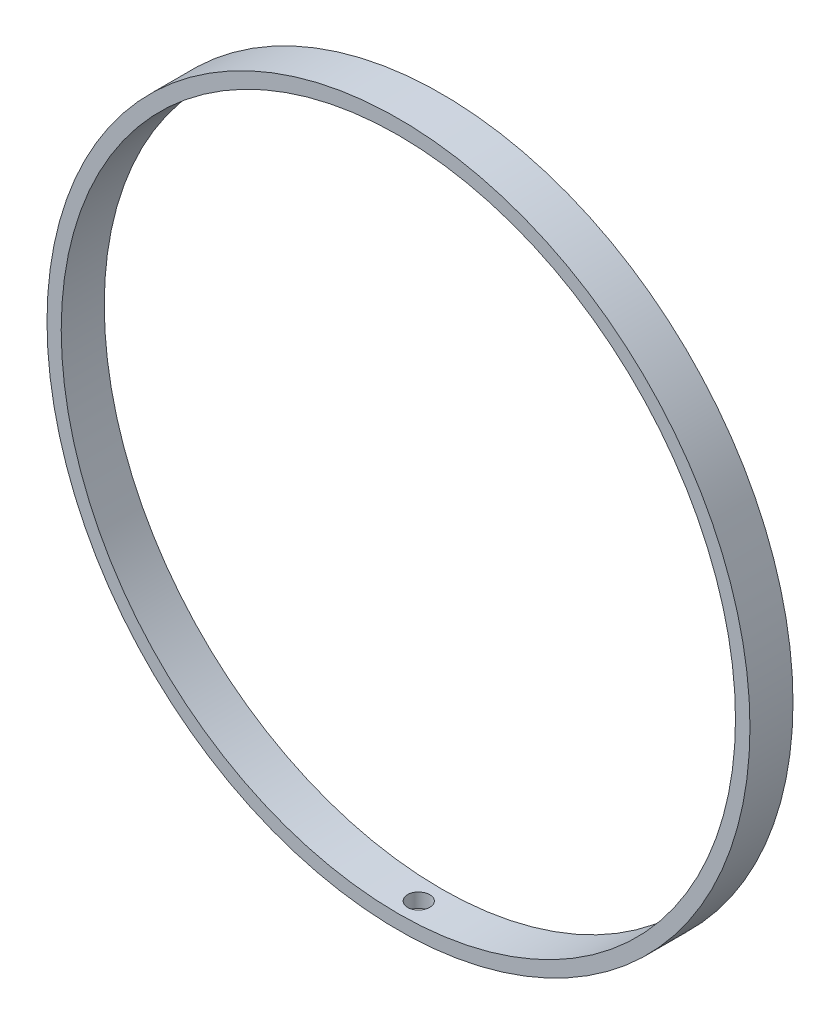
ISO-10303-21;
HEADER;
FILE_DESCRIPTION(('STEP AP214'),'2;1');
FILE_NAME('part.step','',(''),(''),'','','');
FILE_SCHEMA(('AUTOMOTIVE_DESIGN { 1 0 10303 214 1 1 1 1 }'));
ENDSEC;
DATA;
#1=APPLICATION_CONTEXT('core data for automotive mechanical design processes');
#2=APPLICATION_PROTOCOL_DEFINITION('international standard','automotive_design',2000,#1);
#3=PRODUCT_CONTEXT('',#1,'mechanical');
#4=PRODUCT('Part','Part','',(#3));
#5=PRODUCT_RELATED_PRODUCT_CATEGORY('part','',(#4));
#6=PRODUCT_DEFINITION_FORMATION('','',#4);
#7=PRODUCT_DEFINITION_CONTEXT('part definition',#1,'design');
#8=PRODUCT_DEFINITION('design','',#6,#7);
#9=PRODUCT_DEFINITION_SHAPE('','',#8);
#10=(LENGTH_UNIT() NAMED_UNIT(*) SI_UNIT(.MILLI.,.METRE.));
#11=(NAMED_UNIT(*) PLANE_ANGLE_UNIT() SI_UNIT($,.RADIAN.));
#12=(NAMED_UNIT(*) SI_UNIT($,.STERADIAN.) SOLID_ANGLE_UNIT());
#13=UNCERTAINTY_MEASURE_WITH_UNIT(LENGTH_MEASURE(1.E-05),#10,'distance_accuracy_value','');
#14=(GEOMETRIC_REPRESENTATION_CONTEXT(3) GLOBAL_UNCERTAINTY_ASSIGNED_CONTEXT((#13)) GLOBAL_UNIT_ASSIGNED_CONTEXT((#10,
#11,#12)) REPRESENTATION_CONTEXT('',''));
#15=CARTESIAN_POINT('',(0.,0.,0.));
#16=DIRECTION('',(0.,0.,1.));
#17=DIRECTION('',(1.,0.,0.));
#18=AXIS2_PLACEMENT_3D('',#15,#16,#17);
#19=CARTESIAN_POINT('',(-41.0074431900304,19.0391700525141,15.));
#20=DIRECTION('',(0.,0.,-1.));
#21=DIRECTION('',(-1.,0.,0.));
#22=AXIS2_PLACEMENT_3D('',#19,#20,#21);
#23=CYLINDRICAL_SURFACE('',#22,122.5);
#24=CARTESIAN_POINT('',(-41.0074431900304,-103.460829947486,3.78723948126472));
#25=CARTESIAN_POINT('',(-41.2229651427734,-103.460829117167,3.7702370288019));
#26=CARTESIAN_POINT('',(-41.4400782144046,-103.460255036014,3.7714176561021));
#27=CARTESIAN_POINT('',(-41.8711989935256,-103.457974980074,3.81020627033823));
#28=CARTESIAN_POINT('',(-42.0852026856972,-103.456267655252,3.84785772964702));
#29=CARTESIAN_POINT('',(-42.5037580546004,-103.451869705722,3.9585308022687));
#30=CARTESIAN_POINT('',(-42.7083143023761,-103.449179562276,4.03153510987887));
#31=CARTESIAN_POINT('',(-43.1022092069466,-103.443076810642,4.21081296098632));
#32=CARTESIAN_POINT('',(-43.2915515527969,-103.439664378328,4.31707840856741));
#33=CARTESIAN_POINT('',(-43.6497930271661,-103.432459916389,4.55991838901266));
#34=CARTESIAN_POINT('',(-43.818683643981,-103.428667729907,4.69650547474417));
#35=CARTESIAN_POINT('',(-44.1311480445118,-103.421096767702,4.99609679615249));
#36=CARTESIAN_POINT('',(-44.2747208007761,-103.417317992529,5.15910210342084));
#37=CARTESIAN_POINT('',(-44.5325069528811,-103.410168902734,5.50695585439022));
#38=CARTESIAN_POINT('',(-44.6467120176335,-103.406798704162,5.69181047468997));
#39=CARTESIAN_POINT('',(-44.8424637632614,-103.400824443101,6.07808165965811));
#40=CARTESIAN_POINT('',(-44.9240105715648,-103.398220377623,6.27949815970067));
#41=CARTESIAN_POINT('',(-45.0521060679888,-103.394055992124,6.69311330955972));
#42=CARTESIAN_POINT('',(-45.0986651682935,-103.392495361596,6.90530873153273));
#43=CARTESIAN_POINT('',(-45.1554983019861,-103.390583121737,7.33450906583716));
#44=CARTESIAN_POINT('',(-45.1657725193743,-103.390231506276,7.55151395377421));
#45=CARTESIAN_POINT('',(-45.1497472865885,-103.390774717835,7.9840630298798));
#46=CARTESIAN_POINT('',(-45.1234653275082,-103.391668948754,8.19960786706551));
#47=CARTESIAN_POINT('',(-45.0351076304497,-103.394607354938,8.62322365595915));
#48=CARTESIAN_POINT('',(-44.9730318433336,-103.396651531781,8.83129459740646));
#49=CARTESIAN_POINT('',(-44.8148484464726,-103.401672350749,9.23407066946752));
#50=CARTESIAN_POINT('',(-44.7187391043875,-103.404649040338,9.42877511911174));
#51=CARTESIAN_POINT('',(-44.4952186589339,-103.411219384092,9.79928964646579));
#52=CARTESIAN_POINT('',(-44.3678074625528,-103.41481304009,9.97509966802917));
#53=CARTESIAN_POINT('',(-44.0852241449906,-103.422240993303,10.3029293843058));
#54=CARTESIAN_POINT('',(-43.9300380419767,-103.426075411083,10.454937024354));
#55=CARTESIAN_POINT('',(-43.5963479579897,-103.433583520314,10.7307458243977));
#56=CARTESIAN_POINT('',(-43.4178439411803,-103.437257211519,10.854546941043));
#57=CARTESIAN_POINT('',(-43.0425378551712,-103.444067874448,11.0704525519879));
#58=CARTESIAN_POINT('',(-42.8457319000572,-103.447204731788,11.1625502953403));
#59=CARTESIAN_POINT('',(-42.4394391614044,-103.45262814623,11.312393165069));
#60=CARTESIAN_POINT('',(-42.2299524099713,-103.454914705486,11.3701383784165));
#61=CARTESIAN_POINT('',(-41.8043265215596,-103.458422708834,11.4496163432508));
#62=CARTESIAN_POINT('',(-41.5881898641769,-103.459644545072,11.4713623561415));
#63=CARTESIAN_POINT('',(-41.1553300622195,-103.460931864147,11.4782622095372));
#64=CARTESIAN_POINT('',(-40.9386069190436,-103.460997349739,11.4634161372283));
#65=CARTESIAN_POINT('',(-40.5108106302773,-103.460009983128,11.3975659190212));
#66=CARTESIAN_POINT('',(-40.2997354230448,-103.458957544866,11.3465751589962));
#67=CARTESIAN_POINT('',(-39.8891408902647,-103.455897535693,11.2098998760086));
#68=CARTESIAN_POINT('',(-39.6896215771966,-103.45388996375,11.1242153155804));
#69=CARTESIAN_POINT('',(-39.3077639398344,-103.449186958225,10.9205689262058));
#70=CARTESIAN_POINT('',(-39.1254285267047,-103.446491408377,10.8026016413355));
#71=CARTESIAN_POINT('',(-38.7831442597916,-103.440754209769,10.5377433329521));
#72=CARTESIAN_POINT('',(-38.623195475245,-103.437712559939,10.3908522199875));
#73=CARTESIAN_POINT('',(-38.330158143746,-103.431657849252,10.0722457975103));
#74=CARTESIAN_POINT('',(-38.1970804462899,-103.428644800408,9.90052050876157));
#75=CARTESIAN_POINT('',(-37.961642552382,-103.423016014214,9.53716050242446));
#76=CARTESIAN_POINT('',(-37.8592823200447,-103.4204002764,9.34552580809543));
#77=CARTESIAN_POINT('',(-37.6881870977444,-103.415882534061,8.94778369030067));
#78=CARTESIAN_POINT('',(-37.6194520617749,-103.41398052856,8.74167628663716));
#79=CARTESIAN_POINT('',(-37.5175626252271,-103.411119279053,8.32084026724664));
#80=CARTESIAN_POINT('',(-37.4844081969482,-103.410160034312,8.10611165823166));
#81=CARTESIAN_POINT('',(-37.4546296940799,-103.409299704094,7.67421498704491));
#82=CARTESIAN_POINT('',(-37.4579919647275,-103.409398223085,7.45704786705377));
#83=CARTESIAN_POINT('',(-37.5011182165686,-103.410640642219,7.026361490153));
#84=CARTESIAN_POINT('',(-37.5408822416464,-103.411784543622,6.8128422376414));
#85=CARTESIAN_POINT('',(-37.6556744351438,-103.414980198235,6.3955348715885));
#86=CARTESIAN_POINT('',(-37.7306989576154,-103.417031857581,6.19174575434714));
#87=CARTESIAN_POINT('',(-37.9138760396805,-103.421795939064,5.79966154304881));
#88=CARTESIAN_POINT('',(-38.0220273910626,-103.424508337101,5.61136588422758));
#89=CARTESIAN_POINT('',(-38.2684164779673,-103.430266423778,5.25555629476522));
#90=CARTESIAN_POINT('',(-38.4066609825692,-103.433312187328,5.08804705310076));
#91=CARTESIAN_POINT('',(-38.7093472843318,-103.439365246264,4.77856795093857));
#92=CARTESIAN_POINT('',(-38.873795566457,-103.442372531929,4.6366044311153));
#93=CARTESIAN_POINT('',(-39.2242992596087,-103.447976676391,4.38221009820806));
#94=CARTESIAN_POINT('',(-39.4103699387433,-103.450573242076,4.26980033874494));
#95=CARTESIAN_POINT('',(-39.7986093472751,-103.455018546024,4.07793958960662));
#96=CARTESIAN_POINT('',(-40.0007585678203,-103.456868174499,3.99844936293167));
#97=CARTESIAN_POINT('',(-40.3381398401954,-103.459071028104,3.89760594631014));
#98=CARTESIAN_POINT('',(-40.4702923652848,-103.459724954123,3.86562593616861));
#99=CARTESIAN_POINT('',(-40.7372349356283,-103.460604674624,3.81578425304881));
#100=CARTESIAN_POINT('',(-40.8720249803253,-103.460830469197,3.7979225770877));
#101=CARTESIAN_POINT('',(-41.0074431900304,-103.460829947486,3.78723948126472));
#102=B_SPLINE_CURVE_WITH_KNOTS('',3,(#24,#25,#26,#27,#28,#29,#30,#31,#32,#33,#34,#35,#36,#37,
#38,#39,#40,#41,#42,#43,#44,#45,#46,#47,#48,#49,#50,#51,#52,#53,#54,#55,#56,#57,#58,#59,#60,#61,
#62,#63,#64,#65,#66,#67,#68,#69,#70,#71,#72,#73,#74,#75,#76,#77,#78,#79,#80,#81,#82,#83,#84,#85,
#86,#87,#88,#89,#90,#91,#92,#93,#94,#95,#96,#97,#98,#99,#100,#101),.UNSPECIFIED.,.T.,.F.,(4,2,2,
2,2,2,2,2,2,2,2,2,2,2,2,2,2,2,2,2,2,2,2,2,2,2,2,2,2,2,2,2,2,2,2,2,2,2,4),(0.,0.648078911091789,
1.29693126879458,1.94546632497345,2.59384364729884,3.24248989385349,3.8911624577688,
4.5400188359759,5.18887268241139,5.83753335631382,6.48619074085792,7.13453786797999,
7.78288588515776,8.43126690861023,9.07964985873046,9.728360126296,10.3770713908489,
11.0259207072827,11.6747683810007,12.3233769786461,12.9719840308884,13.62035100252,
14.2687186743196,14.9171959908797,15.5656753129885,16.2144159444754,16.863155818074,
17.5118948040544,18.1606332849698,18.8091291901475,19.4576258771236,20.1060555240594,
20.7544615240954,21.4030135259617,22.0517262828021,22.7008999275427,23.3492975755711,
23.7565029823172,24.1637083030313),.UNSPECIFIED.);
#103=CARTESIAN_POINT('',(-41.0074431900304,-103.460829947486,3.78723948126472));
#104=VERTEX_POINT('',#103);
#105=EDGE_CURVE('E57',#104,#104,#102,.T.);
#106=ORIENTED_EDGE('',*,*,#105,.T.);
#107=EDGE_LOOP('',(#106));
#108=FACE_BOUND('',#107,.T.);
#109=CARTESIAN_POINT('',(-41.0074431900304,19.0391700525141,15.));
#110=DIRECTION('',(0.,0.,1.));
#111=DIRECTION('',(1.,0.,0.));
#112=AXIS2_PLACEMENT_3D('',#109,#110,#111);
#113=CIRCLE('',#112,122.5);
#114=CARTESIAN_POINT('',(81.4925568099696,19.0391700525141,15.));
#115=VERTEX_POINT('',#114);
#116=EDGE_CURVE('E11',#115,#115,#113,.T.);
#117=ORIENTED_EDGE('',*,*,#116,.F.);
#118=EDGE_LOOP('',(#117));
#119=FACE_BOUND('',#118,.T.);
#120=CARTESIAN_POINT('',(-41.0074431900304,19.0391700525141,0.));
#121=DIRECTION('',(0.,0.,1.));
#122=DIRECTION('',(1.,0.,0.));
#123=AXIS2_PLACEMENT_3D('',#120,#121,#122);
#124=CIRCLE('',#123,122.5);
#125=CARTESIAN_POINT('',(81.4925568099696,19.0391700525141,0.));
#126=VERTEX_POINT('',#125);
#127=EDGE_CURVE('E45',#126,#126,#124,.T.);
#128=ORIENTED_EDGE('',*,*,#127,.T.);
#129=EDGE_LOOP('',(#128));
#130=FACE_BOUND('',#129,.T.);
#131=ADVANCED_FACE('F33',(#108,#119,#130),#23,.T.);
#132=CARTESIAN_POINT('',(-41.0074431900304,19.0391700525141,15.));
#133=DIRECTION('',(0.,0.,1.));
#134=DIRECTION('',(1.,0.,0.));
#135=AXIS2_PLACEMENT_3D('',#132,#133,#134);
#136=PLANE('',#135);
#137=CARTESIAN_POINT('',(-41.0535415949604,19.002849862926,15.));
#138=DIRECTION('',(0.,0.,1.));
#139=DIRECTION('',(1.,0.,0.));
#140=AXIS2_PLACEMENT_3D('',#137,#138,#139);
#141=CIRCLE('',#140,117.5);
#142=CARTESIAN_POINT('',(76.4464584050396,19.002849862926,15.));
#143=VERTEX_POINT('',#142);
#144=EDGE_CURVE('E50',#143,#143,#141,.T.);
#145=ORIENTED_EDGE('',*,*,#144,.F.);
#146=EDGE_LOOP('',(#145));
#147=FACE_BOUND('',#146,.T.);
#148=ORIENTED_EDGE('',*,*,#116,.T.);
#149=EDGE_LOOP('',(#148));
#150=FACE_BOUND('',#149,.T.);
#151=ADVANCED_FACE('F72',(#147,#150),#136,.T.);
#152=CARTESIAN_POINT('',(-41.0074431900304,19.0391700525141,0.));
#153=DIRECTION('',(0.,0.,1.));
#154=DIRECTION('',(1.,0.,0.));
#155=AXIS2_PLACEMENT_3D('',#152,#153,#154);
#156=PLANE('',#155);
#157=CARTESIAN_POINT('',(-41.0535415949604,19.002849862926,0.));
#158=DIRECTION('',(0.,0.,1.));
#159=DIRECTION('',(1.,0.,0.));
#160=AXIS2_PLACEMENT_3D('',#157,#158,#159);
#161=CIRCLE('',#160,117.5);
#162=CARTESIAN_POINT('',(76.4464584050396,19.002849862926,0.));
#163=VERTEX_POINT('',#162);
#164=EDGE_CURVE('E54',#163,#163,#161,.T.);
#165=ORIENTED_EDGE('',*,*,#164,.T.);
#166=EDGE_LOOP('',(#165));
#167=FACE_BOUND('',#166,.T.);
#168=ORIENTED_EDGE('',*,*,#127,.F.);
#169=EDGE_LOOP('',(#168));
#170=FACE_BOUND('',#169,.T.);
#171=ADVANCED_FACE('F70',(#167,#170),#156,.F.);
#172=CARTESIAN_POINT('',(-41.0535415949604,19.002849862926,0.));
#173=DIRECTION('',(0.,0.,1.));
#174=DIRECTION('',(1.,0.,0.));
#175=AXIS2_PLACEMENT_3D('',#172,#173,#174);
#176=CYLINDRICAL_SURFACE('',#175,117.5);
#177=CARTESIAN_POINT('',(-41.3103975066581,-98.4968693922306,11.4753013205316));
#178=CARTESIAN_POINT('',(-41.5266015317898,-98.4963959180025,11.4752917503873));
#179=CARTESIAN_POINT('',(-41.7429595893583,-98.4953206662736,11.457028160278));
#180=CARTESIAN_POINT('',(-42.1697101390911,-98.4920430322538,11.3844281816025));
#181=CARTESIAN_POINT('',(-42.3800951979301,-98.4898393053562,11.3300487370788));
#182=CARTESIAN_POINT('',(-42.7886558606696,-98.484515845512,11.1867716287245));
#183=CARTESIAN_POINT('',(-42.9868374324662,-98.4813965646743,11.0978909949268));
#184=CARTESIAN_POINT('',(-43.3654111455332,-98.4745571144572,10.888159240287));
#185=CARTESIAN_POINT('',(-43.5458076004956,-98.4708370913651,10.7673158981588));
#186=CARTESIAN_POINT('',(-43.8838435994704,-98.4631794289572,10.4970128909578));
#187=CARTESIAN_POINT('',(-44.0414725420753,-98.4592416894369,10.3475399697478));
#188=CARTESIAN_POINT('',(-44.3294089136533,-98.4515646700601,10.0242447521366));
#189=CARTESIAN_POINT('',(-44.4597152542462,-98.4478253981139,9.85042148621339));
#190=CARTESIAN_POINT('',(-44.6893216417022,-98.440942431191,9.48332429747309));
#191=CARTESIAN_POINT('',(-44.788616189094,-98.4377988418884,9.29004693279307));
#192=CARTESIAN_POINT('',(-44.9533429988623,-98.432444577888,8.88955225962114));
#193=CARTESIAN_POINT('',(-45.0187754243168,-98.4302338986973,8.6823350182683));
#194=CARTESIAN_POINT('',(-45.1138937622003,-98.4269837749215,8.25993733485307));
#195=CARTESIAN_POINT('',(-45.1435950516522,-98.4259438265205,8.04476035941507));
#196=CARTESIAN_POINT('',(-45.1664555838593,-98.4251454173357,7.61247230579987));
#197=CARTESIAN_POINT('',(-45.1596149996575,-98.4253869504836,7.39536123678637));
#198=CARTESIAN_POINT('',(-45.109598111677,-98.4271250922922,6.96546581106066));
#199=CARTESIAN_POINT('',(-45.066437385847,-98.4286211628726,6.75267963943752));
#200=CARTESIAN_POINT('',(-44.945029605071,-98.4327068456771,6.33737498792797));
#201=CARTESIAN_POINT('',(-44.8667824625559,-98.4352964606306,6.13485653366929));
#202=CARTESIAN_POINT('',(-44.6774055002261,-98.4412923594581,5.74578615666401));
#203=CARTESIAN_POINT('',(-44.5662685874317,-98.4446988194622,5.55923768919097));
#204=CARTESIAN_POINT('',(-44.3142724649162,-98.4519647221335,5.20744038439458));
#205=CARTESIAN_POINT('',(-44.1734131601506,-98.4558241662493,5.04219161518482));
#206=CARTESIAN_POINT('',(-43.8658809693204,-98.4635894383265,4.73759140341541));
#207=CARTESIAN_POINT('',(-43.699194252522,-98.4674952900986,4.59825392498492));
#208=CARTESIAN_POINT('',(-43.3447877522185,-98.4749418783763,4.34953848262722));
#209=CARTESIAN_POINT('',(-43.1570679577296,-98.4784826146912,4.24016053434546));
#210=CARTESIAN_POINT('',(-42.765906047049,-98.4848347176292,4.0544652588193));
#211=CARTESIAN_POINT('',(-42.5624629490979,-98.4876460386598,3.97814999797006));
#212=CARTESIAN_POINT('',(-42.1456402496366,-98.4922595284916,3.86076292083085));
#213=CARTESIAN_POINT('',(-41.9322606804903,-98.4940617005794,3.81969098975918));
#214=CARTESIAN_POINT('',(-41.501730766046,-98.4964924043481,3.77397286536824));
#215=CARTESIAN_POINT('',(-41.2845822665105,-98.4971214950187,3.76930931957247));
#216=CARTESIAN_POINT('',(-40.8525833614981,-98.4971768536977,3.79649647201789));
#217=CARTESIAN_POINT('',(-40.6377329519882,-98.4966031238174,3.82834710616943));
#218=CARTESIAN_POINT('',(-40.2164907736104,-98.4943574311774,3.92764241019571));
#219=CARTESIAN_POINT('',(-40.0100966677455,-98.4926857740474,3.99507717350221));
#220=CARTESIAN_POINT('',(-39.6115572255,-98.4884708159852,4.16361792854849));
#221=CARTESIAN_POINT('',(-39.4194119183736,-98.4859275132635,4.26472398941616));
#222=CARTESIAN_POINT('',(-39.0547576969173,-98.4802901020746,4.49777432040142));
#223=CARTESIAN_POINT('',(-38.8822549957284,-98.4771958201165,4.62972830793603));
#224=CARTESIAN_POINT('',(-38.5618441914101,-98.4708373041862,4.92071465788681));
#225=CARTESIAN_POINT('',(-38.413936160684,-98.4675730697137,5.07974710001536));
#226=CARTESIAN_POINT('',(-38.146855943024,-98.4612684180073,5.42044874349236));
#227=CARTESIAN_POINT('',(-38.0276948039326,-98.4582280871336,5.60212660724793));
#228=CARTESIAN_POINT('',(-37.821565626149,-98.4527375267918,5.9829174968308));
#229=CARTESIAN_POINT('',(-37.7345975183123,-98.4502872960561,6.18203048520962));
#230=CARTESIAN_POINT('',(-37.5953372133826,-98.4462697973168,6.59201075849097));
#231=CARTESIAN_POINT('',(-37.5430399672804,-98.4447024007537,6.80287632705125));
#232=CARTESIAN_POINT('',(-37.4745901545901,-98.4426366277799,7.23039988552753));
#233=CARTESIAN_POINT('',(-37.4584375509819,-98.4421382502744,7.44705786951056));
#234=CARTESIAN_POINT('',(-37.462736247026,-98.4422697470648,7.8799198242433));
#235=CARTESIAN_POINT('',(-37.4831723727752,-98.4428991536516,8.09612394599013));
#236=CARTESIAN_POINT('',(-37.5600372225778,-98.4452105108282,8.52203097322231));
#237=CARTESIAN_POINT('',(-37.6164660197787,-98.446892463557,8.73173386549438));
#238=CARTESIAN_POINT('',(-37.7637123508385,-98.451108827733,9.13869140954526));
#239=CARTESIAN_POINT('',(-37.8545304506495,-98.4536432532094,9.33594585639501));
#240=CARTESIAN_POINT('',(-38.0679726166744,-98.4592620074102,9.71240414413736));
#241=CARTESIAN_POINT('',(-38.1905955416255,-98.4623463164017,9.89160863240223));
#242=CARTESIAN_POINT('',(-38.4642122828186,-98.4686958550244,10.2269501370757));
#243=CARTESIAN_POINT('',(-38.6152148378744,-98.471961140164,10.3830800216998));
#244=CARTESIAN_POINT('',(-38.9413332636783,-98.4782767699211,10.6678159926157));
#245=CARTESIAN_POINT('',(-39.1164550829667,-98.4813270612332,10.7964152689787));
#246=CARTESIAN_POINT('',(-39.4859049871474,-98.4868375379483,11.0224581225569));
#247=CARTESIAN_POINT('',(-39.6802449735542,-98.489297354407,11.119882233293));
#248=CARTESIAN_POINT('',(-40.0823812910349,-98.4933079949814,11.2806065321451));
#249=CARTESIAN_POINT('',(-40.2901612572001,-98.4948599022881,11.343947376399));
#250=CARTESIAN_POINT('',(-40.6344427738803,-98.4964782322815,11.4179370226522));
#251=CARTESIAN_POINT('',(-40.7687108561693,-98.4968824786885,11.4394216118434));
#252=CARTESIAN_POINT('',(-41.0387648578742,-98.4972268067886,11.4681067646198));
#253=CARTESIAN_POINT('',(-41.1745507767054,-98.4971668886605,11.4753073337074));
#254=CARTESIAN_POINT('',(-41.3103975066581,-98.4968693922306,11.4753013205316));
#255=B_SPLINE_CURVE_WITH_KNOTS('',3,(#177,#178,#179,#180,#181,#182,#183,#184,#185,#186,#187,
#188,#189,#190,#191,#192,#193,#194,#195,#196,#197,#198,#199,#200,#201,#202,#203,#204,#205,#206,
#207,#208,#209,#210,#211,#212,#213,#214,#215,#216,#217,#218,#219,#220,#221,#222,#223,#224,#225,
#226,#227,#228,#229,#230,#231,#232,#233,#234,#235,#236,#237,#238,#239,#240,#241,#242,#243,#244,
#245,#246,#247,#248,#249,#250,#251,#252,#253,#254),.UNSPECIFIED.,.T.,.F.,(4,2,2,2,2,2,2,2,2,2,2,
2,2,2,2,2,2,2,2,2,2,2,2,2,2,2,2,2,2,2,2,2,2,2,2,2,2,2,4),(0.,0.648117732582533,1.29700951693001,
1.94558141012768,2.593995606405,3.24271076196413,3.89145175381053,4.54030772479679,
5.1891605709006,5.83773408084354,6.48630451948861,7.13459692368542,7.78289094590925,
8.4313248806785,9.0797608890012,9.72854534649709,10.3773301428005,11.0261554818585,
11.6749787077918,12.3234926814079,12.9720055167548,13.6203379022795,14.2686716188525,
14.9172098431288,15.5657499765767,16.2145389576467,16.8633265452328,17.512019631141,
18.1607120526428,18.8091355138338,19.4575602928123,20.1059957435191,20.7544079294238,
21.4030201061254,22.0517925376285,22.7009692903706,23.3493699479198,23.7565996859274,
24.1638292670698),.UNSPECIFIED.);
#256=CARTESIAN_POINT('',(-41.3103975066581,-98.4968693922306,11.4753013205316));
#257=VERTEX_POINT('',#256);
#258=EDGE_CURVE('E37',#257,#257,#255,.T.);
#259=ORIENTED_EDGE('',*,*,#258,.T.);
#260=EDGE_LOOP('',(#259));
#261=FACE_BOUND('',#260,.T.);
#262=ORIENTED_EDGE('',*,*,#144,.T.);
#263=EDGE_LOOP('',(#262));
#264=FACE_BOUND('',#263,.T.);
#265=ORIENTED_EDGE('',*,*,#164,.F.);
#266=EDGE_LOOP('',(#265));
#267=FACE_BOUND('',#266,.T.);
#268=ADVANCED_FACE('F64',(#261,#264,#267),#176,.F.);
#269=CARTESIAN_POINT('',(-41.3103975066581,-103.460829947486,7.62530132053159));
#270=DIRECTION('',(0.,1.,0.));
#271=DIRECTION('',(0.,0.,1.));
#272=AXIS2_PLACEMENT_3D('',#269,#270,#271);
#273=CYLINDRICAL_SURFACE('',#272,3.85);
#274=ORIENTED_EDGE('',*,*,#258,.F.);
#275=EDGE_LOOP('',(#274));
#276=FACE_BOUND('',#275,.T.);
#277=ORIENTED_EDGE('',*,*,#105,.F.);
#278=EDGE_LOOP('',(#277));
#279=FACE_BOUND('',#278,.T.);
#280=ADVANCED_FACE('F61',(#276,#279),#273,.F.);
#281=CLOSED_SHELL('',(#131,#151,#171,#268,#280));
#282=MANIFOLD_SOLID_BREP('B2',#281);
#283=ADVANCED_BREP_SHAPE_REPRESENTATION('',(#18,#282),#14);
#284=SHAPE_DEFINITION_REPRESENTATION(#9,#283);
ENDSEC;
END-ISO-10303-21;
